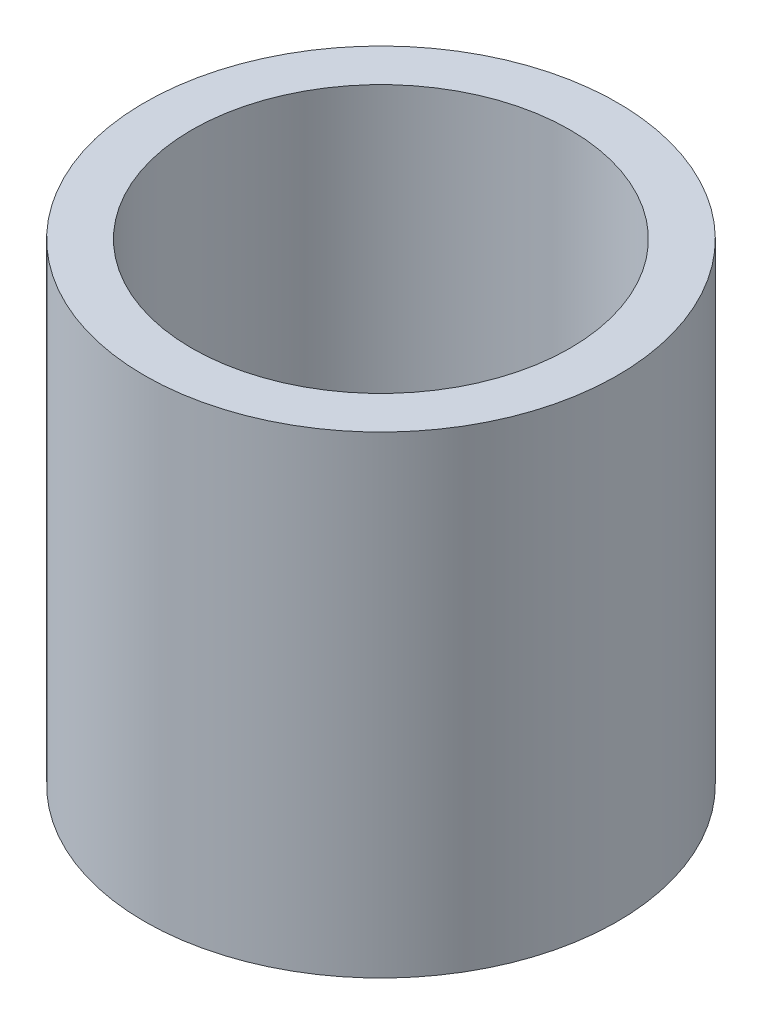
ISO-10303-21;
HEADER;
FILE_DESCRIPTION(('STEP AP214'),'2;1');
FILE_NAME('part.step','',(''),(''),'','','');
FILE_SCHEMA(('AUTOMOTIVE_DESIGN { 1 0 10303 214 1 1 1 1 }'));
ENDSEC;
DATA;
#1=APPLICATION_CONTEXT('core data for automotive mechanical design processes');
#2=APPLICATION_PROTOCOL_DEFINITION('international standard','automotive_design',2000,#1);
#3=PRODUCT_CONTEXT('',#1,'mechanical');
#4=PRODUCT('Part','Part','',(#3));
#5=PRODUCT_RELATED_PRODUCT_CATEGORY('part','',(#4));
#6=PRODUCT_DEFINITION_FORMATION('','',#4);
#7=PRODUCT_DEFINITION_CONTEXT('part definition',#1,'design');
#8=PRODUCT_DEFINITION('design','',#6,#7);
#9=PRODUCT_DEFINITION_SHAPE('','',#8);
#10=(LENGTH_UNIT() NAMED_UNIT(*) SI_UNIT(.MILLI.,.METRE.));
#11=(NAMED_UNIT(*) PLANE_ANGLE_UNIT() SI_UNIT($,.RADIAN.));
#12=(NAMED_UNIT(*) SI_UNIT($,.STERADIAN.) SOLID_ANGLE_UNIT());
#13=UNCERTAINTY_MEASURE_WITH_UNIT(LENGTH_MEASURE(1.E-05),#10,'distance_accuracy_value','');
#14=(GEOMETRIC_REPRESENTATION_CONTEXT(3) GLOBAL_UNCERTAINTY_ASSIGNED_CONTEXT((#13)) GLOBAL_UNIT_ASSIGNED_CONTEXT((#10,
#11,#12)) REPRESENTATION_CONTEXT('',''));
#15=CARTESIAN_POINT('',(0.,0.,0.));
#16=DIRECTION('',(0.,0.,1.));
#17=DIRECTION('',(1.,0.,0.));
#18=AXIS2_PLACEMENT_3D('',#15,#16,#17);
#19=CARTESIAN_POINT('',(-4.05927662424649,12.7,-2.55341594105827));
#20=DIRECTION('',(0.,-1.,0.));
#21=DIRECTION('',(0.,0.,-1.));
#22=AXIS2_PLACEMENT_3D('',#19,#20,#21);
#23=CYLINDRICAL_SURFACE('',#22,6.35);
#24=CARTESIAN_POINT('',(-4.05927662424649,12.7,-2.55341594105827));
#25=DIRECTION('',(0.,1.,0.));
#26=DIRECTION('',(0.,0.,1.));
#27=AXIS2_PLACEMENT_3D('',#24,#25,#26);
#28=CIRCLE('',#27,6.35);
#29=CARTESIAN_POINT('',(-4.05927662424649,12.7,3.79658405894173));
#30=VERTEX_POINT('',#29);
#31=EDGE_CURVE('E10',#30,#30,#28,.T.);
#32=ORIENTED_EDGE('',*,*,#31,.F.);
#33=EDGE_LOOP('',(#32));
#34=FACE_BOUND('',#33,.T.);
#35=CARTESIAN_POINT('',(-4.05927662424649,0.,-2.55341594105827));
#36=DIRECTION('',(0.,1.,0.));
#37=DIRECTION('',(0.,0.,1.));
#38=AXIS2_PLACEMENT_3D('',#35,#36,#37);
#39=CIRCLE('',#38,6.35);
#40=CARTESIAN_POINT('',(-4.05927662424649,0.,3.79658405894173));
#41=VERTEX_POINT('',#40);
#42=EDGE_CURVE('E38',#41,#41,#39,.T.);
#43=ORIENTED_EDGE('',*,*,#42,.T.);
#44=EDGE_LOOP('',(#43));
#45=FACE_BOUND('',#44,.T.);
#46=ADVANCED_FACE('F31',(#34,#45),#23,.T.);
#47=CARTESIAN_POINT('',(-4.05927662424649,12.7,-2.55341594105827));
#48=DIRECTION('',(0.,1.,0.));
#49=DIRECTION('',(0.,0.,1.));
#50=AXIS2_PLACEMENT_3D('',#47,#48,#49);
#51=PLANE('',#50);
#52=CARTESIAN_POINT('',(-4.05927662424649,12.7,-2.55341594105827));
#53=DIRECTION('',(0.,1.,0.));
#54=DIRECTION('',(0.,0.,1.));
#55=AXIS2_PLACEMENT_3D('',#52,#53,#54);
#56=CIRCLE('',#55,5.08);
#57=CARTESIAN_POINT('',(-4.05927662424649,12.7,2.52658405894173));
#58=VERTEX_POINT('',#57);
#59=EDGE_CURVE('E44',#58,#58,#56,.T.);
#60=ORIENTED_EDGE('',*,*,#59,.F.);
#61=EDGE_LOOP('',(#60));
#62=FACE_BOUND('',#61,.T.);
#63=ORIENTED_EDGE('',*,*,#31,.T.);
#64=EDGE_LOOP('',(#63));
#65=FACE_BOUND('',#64,.T.);
#66=ADVANCED_FACE('F60',(#62,#65),#51,.T.);
#67=CARTESIAN_POINT('',(-4.05927662424649,0.,-2.55341594105827));
#68=DIRECTION('',(0.,1.,0.));
#69=DIRECTION('',(0.,0.,1.));
#70=AXIS2_PLACEMENT_3D('',#67,#68,#69);
#71=PLANE('',#70);
#72=CARTESIAN_POINT('',(-4.05927662424649,0.,-2.55341594105827));
#73=DIRECTION('',(0.,1.,0.));
#74=DIRECTION('',(0.,0.,1.));
#75=AXIS2_PLACEMENT_3D('',#72,#73,#74);
#76=CIRCLE('',#75,5.08);
#77=CARTESIAN_POINT('',(-4.05927662424649,0.,2.52658405894173));
#78=VERTEX_POINT('',#77);
#79=EDGE_CURVE('E34',#78,#78,#76,.T.);
#80=ORIENTED_EDGE('',*,*,#79,.T.);
#81=EDGE_LOOP('',(#80));
#82=FACE_BOUND('',#81,.T.);
#83=ORIENTED_EDGE('',*,*,#42,.F.);
#84=EDGE_LOOP('',(#83));
#85=FACE_BOUND('',#84,.T.);
#86=ADVANCED_FACE('F51',(#82,#85),#71,.F.);
#87=CARTESIAN_POINT('',(-4.05927662424649,-1.01600000000002,-2.55341594105827));
#88=DIRECTION('',(0.,1.,0.));
#89=DIRECTION('',(0.,0.,1.));
#90=AXIS2_PLACEMENT_3D('',#87,#88,#89);
#91=CYLINDRICAL_SURFACE('',#90,5.08);
#92=ORIENTED_EDGE('',*,*,#59,.T.);
#93=EDGE_LOOP('',(#92));
#94=FACE_BOUND('',#93,.T.);
#95=ORIENTED_EDGE('',*,*,#79,.F.);
#96=EDGE_LOOP('',(#95));
#97=FACE_BOUND('',#96,.T.);
#98=ADVANCED_FACE('F54',(#94,#97),#91,.F.);
#99=CLOSED_SHELL('',(#46,#66,#86,#98));
#100=MANIFOLD_SOLID_BREP('B2',#99);
#101=ADVANCED_BREP_SHAPE_REPRESENTATION('',(#18,#100),#14);
#102=SHAPE_DEFINITION_REPRESENTATION(#9,#101);
ENDSEC;
END-ISO-10303-21;
